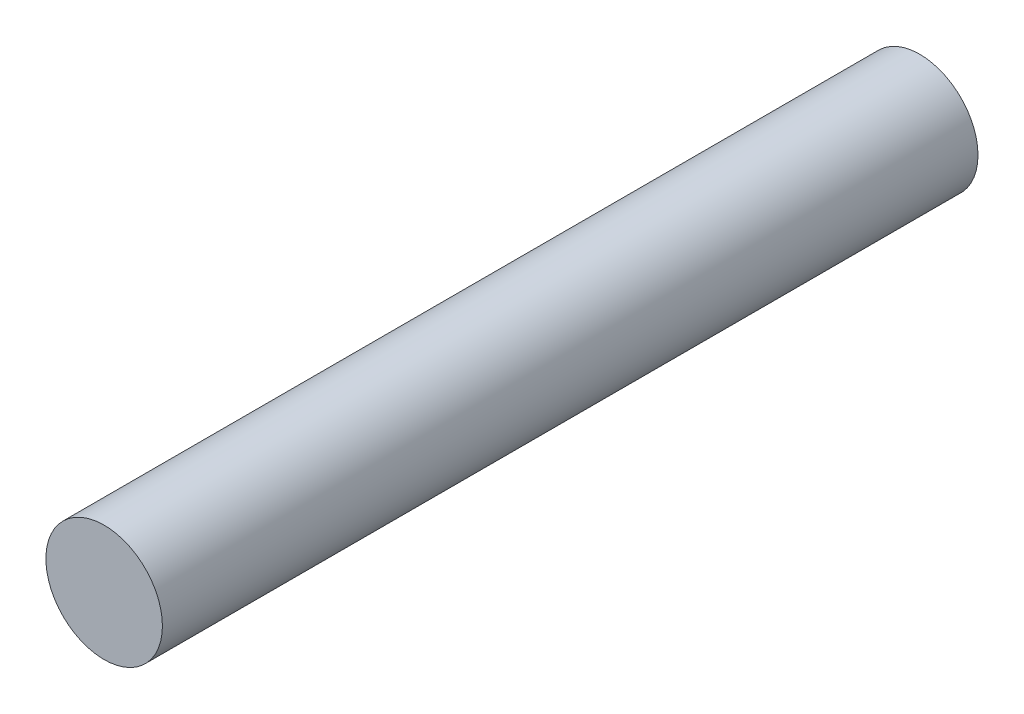
ISO-10303-21;
HEADER;
FILE_DESCRIPTION(('STEP AP214'),'2;1');
FILE_NAME('part.step','',(''),(''),'','','');
FILE_SCHEMA(('AUTOMOTIVE_DESIGN { 1 0 10303 214 1 1 1 1 }'));
ENDSEC;
DATA;
#1=APPLICATION_CONTEXT('core data for automotive mechanical design processes');
#2=APPLICATION_PROTOCOL_DEFINITION('international standard','automotive_design',2000,#1);
#3=PRODUCT_CONTEXT('',#1,'mechanical');
#4=PRODUCT('Part','Part','',(#3));
#5=PRODUCT_RELATED_PRODUCT_CATEGORY('part','',(#4));
#6=PRODUCT_DEFINITION_FORMATION('','',#4);
#7=PRODUCT_DEFINITION_CONTEXT('part definition',#1,'design');
#8=PRODUCT_DEFINITION('design','',#6,#7);
#9=PRODUCT_DEFINITION_SHAPE('','',#8);
#10=(LENGTH_UNIT() NAMED_UNIT(*) SI_UNIT(.MILLI.,.METRE.));
#11=(NAMED_UNIT(*) PLANE_ANGLE_UNIT() SI_UNIT($,.RADIAN.));
#12=(NAMED_UNIT(*) SI_UNIT($,.STERADIAN.) SOLID_ANGLE_UNIT());
#13=UNCERTAINTY_MEASURE_WITH_UNIT(LENGTH_MEASURE(1.E-05),#10,'distance_accuracy_value','');
#14=(GEOMETRIC_REPRESENTATION_CONTEXT(3) GLOBAL_UNCERTAINTY_ASSIGNED_CONTEXT((#13)) GLOBAL_UNIT_ASSIGNED_CONTEXT((#10,
#11,#12)) REPRESENTATION_CONTEXT('',''));
#15=CARTESIAN_POINT('',(0.,0.,0.));
#16=DIRECTION('',(0.,0.,1.));
#17=DIRECTION('',(1.,0.,0.));
#18=AXIS2_PLACEMENT_3D('',#15,#16,#17);
#19=CARTESIAN_POINT('',(0.,0.,70.));
#20=DIRECTION('',(0.,0.,-1.));
#21=DIRECTION('',(-1.,0.,0.));
#22=AXIS2_PLACEMENT_3D('',#19,#20,#21);
#23=CYLINDRICAL_SURFACE('',#22,5.);
#24=CARTESIAN_POINT('',(0.,0.,70.));
#25=DIRECTION('',(0.,0.,1.));
#26=DIRECTION('',(1.,0.,0.));
#27=AXIS2_PLACEMENT_3D('',#24,#25,#26);
#28=CIRCLE('',#27,5.);
#29=CARTESIAN_POINT('',(5.,0.,70.));
#30=VERTEX_POINT('',#29);
#31=EDGE_CURVE('E10',#30,#30,#28,.T.);
#32=ORIENTED_EDGE('',*,*,#31,.F.);
#33=EDGE_LOOP('',(#32));
#34=FACE_BOUND('',#33,.T.);
#35=CARTESIAN_POINT('',(0.,0.,0.));
#36=DIRECTION('',(0.,0.,1.));
#37=DIRECTION('',(1.,0.,0.));
#38=AXIS2_PLACEMENT_3D('',#35,#36,#37);
#39=CIRCLE('',#38,5.);
#40=CARTESIAN_POINT('',(5.,0.,0.));
#41=VERTEX_POINT('',#40);
#42=EDGE_CURVE('E42',#41,#41,#39,.T.);
#43=ORIENTED_EDGE('',*,*,#42,.T.);
#44=EDGE_LOOP('',(#43));
#45=FACE_BOUND('',#44,.T.);
#46=ADVANCED_FACE('F39',(#34,#45),#23,.T.);
#47=CARTESIAN_POINT('',(0.,0.,70.));
#48=DIRECTION('',(0.,0.,1.));
#49=DIRECTION('',(1.,0.,0.));
#50=AXIS2_PLACEMENT_3D('',#47,#48,#49);
#51=PLANE('',#50);
#52=ORIENTED_EDGE('',*,*,#31,.T.);
#53=EDGE_LOOP('',(#52));
#54=FACE_BOUND('',#53,.T.);
#55=ADVANCED_FACE('F68',(#54),#51,.T.);
#56=CARTESIAN_POINT('',(0.,0.,0.));
#57=DIRECTION('',(0.,0.,1.));
#58=DIRECTION('',(1.,0.,0.));
#59=AXIS2_PLACEMENT_3D('',#56,#57,#58);
#60=PLANE('',#59);
#61=CARTESIAN_POINT('',(0.,0.,0.));
#62=DIRECTION('',(0.,0.,-1.));
#63=DIRECTION('',(-1.,0.,0.));
#64=AXIS2_PLACEMENT_3D('',#61,#62,#63);
#65=CIRCLE('',#64,2.5);
#66=CARTESIAN_POINT('',(-2.5,0.,0.));
#67=VERTEX_POINT('',#66);
#68=EDGE_CURVE('E51',#67,#67,#65,.T.);
#69=ORIENTED_EDGE('',*,*,#68,.F.);
#70=EDGE_LOOP('',(#69));
#71=FACE_BOUND('',#70,.T.);
#72=ORIENTED_EDGE('',*,*,#42,.F.);
#73=EDGE_LOOP('',(#72));
#74=FACE_BOUND('',#73,.T.);
#75=ADVANCED_FACE('F62',(#71,#74),#60,.F.);
#76=CARTESIAN_POINT('',(0.,0.,16.));
#77=DIRECTION('',(0.,0.,-1.));
#78=DIRECTION('',(-1.,0.,0.));
#79=AXIS2_PLACEMENT_3D('',#76,#77,#78);
#80=CYLINDRICAL_SURFACE('',#79,2.5);
#81=CARTESIAN_POINT('',(0.,0.,16.));
#82=DIRECTION('',(0.,0.,-1.));
#83=DIRECTION('',(-1.,0.,0.));
#84=AXIS2_PLACEMENT_3D('',#81,#82,#83);
#85=CIRCLE('',#84,2.5);
#86=CARTESIAN_POINT('',(-2.5,0.,16.));
#87=VERTEX_POINT('',#86);
#88=EDGE_CURVE('E49',#87,#87,#85,.T.);
#89=ORIENTED_EDGE('',*,*,#88,.F.);
#90=EDGE_LOOP('',(#89));
#91=FACE_BOUND('',#90,.T.);
#92=ORIENTED_EDGE('',*,*,#68,.T.);
#93=EDGE_LOOP('',(#92));
#94=FACE_BOUND('',#93,.T.);
#95=ADVANCED_FACE('F59',(#91,#94),#80,.F.);
#96=CARTESIAN_POINT('',(0.,0.,16.));
#97=DIRECTION('',(0.,0.,-1.));
#98=DIRECTION('',(-1.,0.,0.));
#99=AXIS2_PLACEMENT_3D('',#96,#97,#98);
#100=PLANE('',#99);
#101=ORIENTED_EDGE('',*,*,#88,.T.);
#102=EDGE_LOOP('',(#101));
#103=FACE_BOUND('',#102,.T.);
#104=ADVANCED_FACE('F57',(#103),#100,.T.);
#105=CLOSED_SHELL('',(#46,#55,#75,#95,#104));
#106=MANIFOLD_SOLID_BREP('B2',#105);
#107=ADVANCED_BREP_SHAPE_REPRESENTATION('',(#18,#106),#14);
#108=SHAPE_DEFINITION_REPRESENTATION(#9,#107);
ENDSEC;
END-ISO-10303-21;
